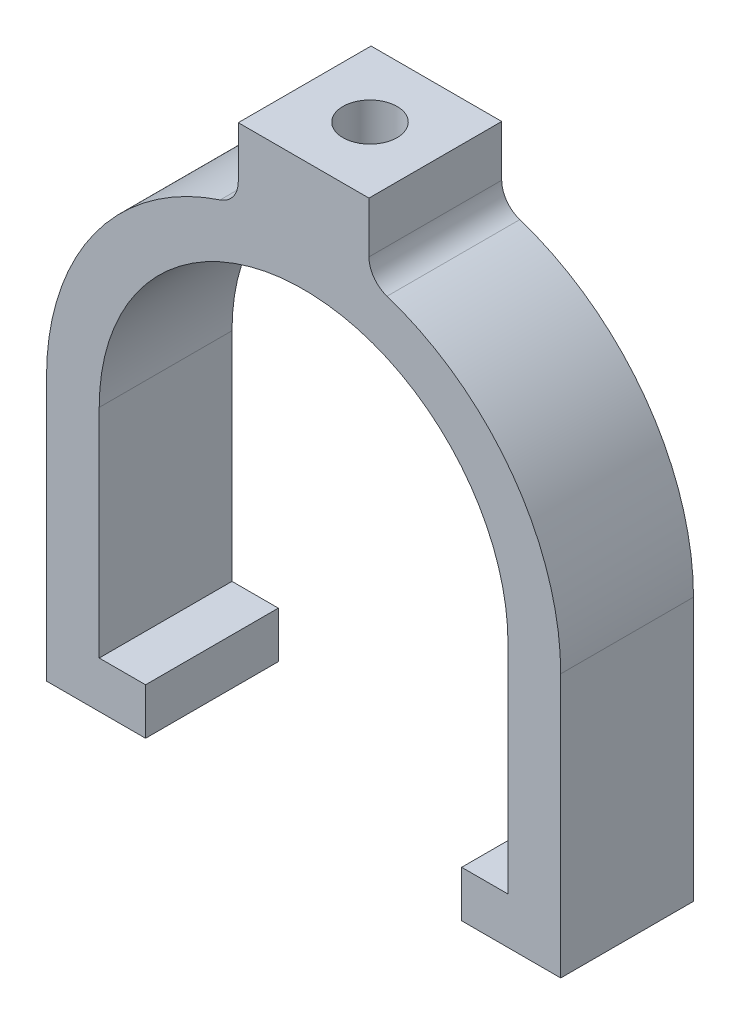
ISO-10303-21;
HEADER;
FILE_DESCRIPTION(('STEP AP214'),'2;1');
FILE_NAME('part.step','',(''),(''),'','','');
FILE_SCHEMA(('AUTOMOTIVE_DESIGN { 1 0 10303 214 1 1 1 1 }'));
ENDSEC;
DATA;
#1=APPLICATION_CONTEXT('core data for automotive mechanical design processes');
#2=APPLICATION_PROTOCOL_DEFINITION('international standard','automotive_design',2000,#1);
#3=PRODUCT_CONTEXT('',#1,'mechanical');
#4=PRODUCT('Part','Part','',(#3));
#5=PRODUCT_RELATED_PRODUCT_CATEGORY('part','',(#4));
#6=PRODUCT_DEFINITION_FORMATION('','',#4);
#7=PRODUCT_DEFINITION_CONTEXT('part definition',#1,'design');
#8=PRODUCT_DEFINITION('design','',#6,#7);
#9=PRODUCT_DEFINITION_SHAPE('','',#8);
#10=(LENGTH_UNIT() NAMED_UNIT(*) SI_UNIT(.MILLI.,.METRE.));
#11=(NAMED_UNIT(*) PLANE_ANGLE_UNIT() SI_UNIT($,.RADIAN.));
#12=(NAMED_UNIT(*) SI_UNIT($,.STERADIAN.) SOLID_ANGLE_UNIT());
#13=UNCERTAINTY_MEASURE_WITH_UNIT(LENGTH_MEASURE(1.E-05),#10,'distance_accuracy_value','');
#14=(GEOMETRIC_REPRESENTATION_CONTEXT(3) GLOBAL_UNCERTAINTY_ASSIGNED_CONTEXT((#13)) GLOBAL_UNIT_ASSIGNED_CONTEXT((#10,
#11,#12)) REPRESENTATION_CONTEXT('',''));
#15=CARTESIAN_POINT('',(0.,0.,0.));
#16=DIRECTION('',(0.,0.,1.));
#17=DIRECTION('',(1.,0.,0.));
#18=AXIS2_PLACEMENT_3D('',#15,#16,#17);
#19=CARTESIAN_POINT('',(0.,0.,16.002));
#20=DIRECTION('',(0.,0.,-1.));
#21=DIRECTION('',(-1.,0.,0.));
#22=AXIS2_PLACEMENT_3D('',#19,#20,#21);
#23=CYLINDRICAL_SURFACE('',#22,24.6349293553025);
#24=CARTESIAN_POINT('',(0.,24.6349293553025,11.2649));
#25=CARTESIAN_POINT('',(0.182477295066391,24.634926687819,11.2648923064662));
#26=CARTESIAN_POINT('',(0.365066336844417,24.6328805037974,11.2495455422252));
#27=CARTESIAN_POINT('',(0.725157182338792,24.6249147191256,11.1885701824628));
#28=CARTESIAN_POINT('',(0.902653580245628,24.6189911506863,11.1429105666369));
#29=CARTESIAN_POINT('',(1.24729446312788,24.6039374576164,11.0226838621394));
#30=CARTESIAN_POINT('',(1.41444606435645,24.5948095667605,10.9481369074574));
#31=CARTESIAN_POINT('',(1.73383668741862,24.574360581481,10.7722971923055));
#32=CARTESIAN_POINT('',(1.88607812406971,24.5630398430935,10.6710087726777));
#33=CARTESIAN_POINT('',(2.17229393058722,24.539389777283,10.4438954985144));
#34=CARTESIAN_POINT('',(2.30616326554295,24.5270552468132,10.3179388036751));
#35=CARTESIAN_POINT('',(2.55092973300952,24.5028093767103,10.0453477546269));
#36=CARTESIAN_POINT('',(2.66182565434552,24.4908980594168,9.89871231090421));
#37=CARTESIAN_POINT('',(2.85789384928716,24.4687963267119,9.58823674239901));
#38=CARTESIAN_POINT('',(2.94296676616854,24.4586126231038,9.42433335389756));
#39=CARTESIAN_POINT('',(3.08433941942857,24.4411885784362,9.08440815359293));
#40=CARTESIAN_POINT('',(3.14064037940339,24.4339481122111,8.90838685749402));
#41=CARTESIAN_POINT('',(3.22254966742672,24.4232805202168,8.55031710611364));
#42=CARTESIAN_POINT('',(3.2483361152611,24.4198312727836,8.36831006683786));
#43=CARTESIAN_POINT('',(3.26903574088053,24.4170691359014,8.00252177700253));
#44=CARTESIAN_POINT('',(3.26395030857054,24.4177560602349,7.81874060668932));
#45=CARTESIAN_POINT('',(3.22319655904242,24.4231684095786,7.45586699141634));
#46=CARTESIAN_POINT('',(3.18772505382378,24.4278678447306,7.27675199987283));
#47=CARTESIAN_POINT('',(3.08751342408681,24.4407351582205,6.92703920094534));
#48=CARTESIAN_POINT('',(3.0227726399305,24.4489031147277,6.7564415856126));
#49=CARTESIAN_POINT('',(2.86565059629395,24.4678164095599,6.42799830746867));
#50=CARTESIAN_POINT('',(2.77318442041531,24.4785696456462,6.27019374067579));
#51=CARTESIAN_POINT('',(2.56329703621076,24.5014358979219,5.97226659289486));
#52=CARTESIAN_POINT('',(2.44587454649227,24.5135489839182,5.83214492043156));
#53=CARTESIAN_POINT('',(2.18831990960694,24.5378854446139,5.57241921185461));
#54=CARTESIAN_POINT('',(2.04801823886873,24.5501089443614,5.45298322976456));
#55=CARTESIAN_POINT('',(1.74926990974521,24.5732010020668,5.23932981558359));
#56=CARTESIAN_POINT('',(1.59082320023426,24.5840695562067,5.14511245455139));
#57=CARTESIAN_POINT('',(1.26014840322894,24.6032350889691,4.98456826259667));
#58=CARTESIAN_POINT('',(1.08791481048324,24.6115310338112,4.91825263993302));
#59=CARTESIAN_POINT('',(0.734622100735637,24.6246074883933,4.81553134211751));
#60=CARTESIAN_POINT('',(0.553563448796386,24.6293881831668,4.77912409265663));
#61=CARTESIAN_POINT('',(0.189212534154061,24.6348713073908,4.7374724070735));
#62=CARTESIAN_POINT('',(0.00594715922095119,24.635604015351,4.731996600111));
#63=CARTESIAN_POINT('',(-0.358887658590362,24.6329905492089,4.75175165237506));
#64=CARTESIAN_POINT('',(-0.540457142050211,24.6296444729627,4.77698177492074));
#65=CARTESIAN_POINT('',(-0.896058287663356,24.6192682161786,4.85724022183569));
#66=CARTESIAN_POINT('',(-1.07011543633544,24.6122517619122,4.91215754906424));
#67=CARTESIAN_POINT('',(-1.40655024610518,24.5953198553614,5.0501156410819));
#68=CARTESIAN_POINT('',(-1.56892746632877,24.585404293718,5.13315746679201));
#69=CARTESIAN_POINT('',(-1.87842199094253,24.5637031270432,5.32556230781356));
#70=CARTESIAN_POINT('',(-2.02544601184283,24.55190707963,5.43507417669855));
#71=CARTESIAN_POINT('',(-2.29910995846418,24.5277953750702,5.67710082643969));
#72=CARTESIAN_POINT('',(-2.42574897045137,24.5154796946628,5.80961663786724));
#73=CARTESIAN_POINT('',(-2.65587491401639,24.491622618108,6.09491183959354));
#74=CARTESIAN_POINT('',(-2.7592079772703,24.4800867009389,6.24781586950581));
#75=CARTESIAN_POINT('',(-2.93872396594442,24.4591873942987,6.56894561342848));
#76=CARTESIAN_POINT('',(-3.0149074913018,24.4498239568229,6.73717098877216));
#77=CARTESIAN_POINT('',(-3.13771568935901,24.4343678155246,7.08368226448073));
#78=CARTESIAN_POINT('',(-3.18442548383509,24.4282657007027,7.26193755870111));
#79=CARTESIAN_POINT('',(-3.24723359105593,24.4199966939658,7.62384813177584));
#80=CARTESIAN_POINT('',(-3.26333351886918,24.4178295944279,7.8075031252066));
#81=CARTESIAN_POINT('',(-3.26443276514257,24.4176825330479,8.17346830148521));
#82=CARTESIAN_POINT('',(-3.24967385818498,24.4196700205783,8.35577779193504));
#83=CARTESIAN_POINT('',(-3.18998809210433,24.4275379998099,8.71529975717129));
#84=CARTESIAN_POINT('',(-3.14506124270471,24.4334184902564,8.89251223360051));
#85=CARTESIAN_POINT('',(-3.02639334945747,24.4483994547115,9.23676796924898));
#86=CARTESIAN_POINT('',(-2.95266544737825,24.4574984599501,9.40381582640801));
#87=CARTESIAN_POINT('',(-2.77851207243629,24.4778934527146,9.72320850573454));
#88=CARTESIAN_POINT('',(-2.67808610279616,24.48918948112,9.87555305424214));
#89=CARTESIAN_POINT('',(-2.45249527065869,24.5128116240682,10.1624486155478));
#90=CARTESIAN_POINT('',(-2.32715046536337,24.5251448307099,10.2968575641797));
#91=CARTESIAN_POINT('',(-2.05565777729653,24.5493900041002,10.5428241893124));
#92=CARTESIAN_POINT('',(-1.90950501880091,24.5613018713014,10.6543764950542));
#93=CARTESIAN_POINT('',(-1.59982358458707,24.5834190088614,10.8518751611913));
#94=CARTESIAN_POINT('',(-1.43622344863861,24.5936167827286,10.9377102657878));
#95=CARTESIAN_POINT('',(-1.09688246919574,24.6110816924553,11.0805632789125));
#96=CARTESIAN_POINT('',(-0.921154876495345,24.6183519694044,11.137612090737));
#97=CARTESIAN_POINT('',(-0.620458808698742,24.6274160617012,11.2078162104982));
#98=CARTESIAN_POINT('',(-0.497376088328188,24.6302196139795,11.2291913278247));
#99=CARTESIAN_POINT('',(-0.249546325237752,24.6339771649355,11.2577357918984));
#100=CARTESIAN_POINT('',(-0.124799296948518,24.6349311796395,11.2649052617374));
#101=CARTESIAN_POINT('',(0.,24.6349293553025,11.2649));
#102=B_SPLINE_CURVE_WITH_KNOTS('',3,(#24,#25,#26,#27,#28,#29,#30,#31,#32,#33,#34,#35,#36,#37,
#38,#39,#40,#41,#42,#43,#44,#45,#46,#47,#48,#49,#50,#51,#52,#53,#54,#55,#56,#57,#58,#59,#60,#61,
#62,#63,#64,#65,#66,#67,#68,#69,#70,#71,#72,#73,#74,#75,#76,#77,#78,#79,#80,#81,#82,#83,#84,#85,
#86,#87,#88,#89,#90,#91,#92,#93,#94,#95,#96,#97,#98,#99,#100,#101),.UNSPECIFIED.,.T.,.F.,(4,2,2,
2,2,2,2,2,2,2,2,2,2,2,2,2,2,2,2,2,2,2,2,2,2,2,2,2,2,2,2,2,2,2,2,2,2,2,4),(0.,0.546975984262547,
1.09451257463112,1.6416682256243,2.1887351134372,2.7388097920835,3.28891346368488,
3.84110764365885,4.39327833830217,4.94220974002988,5.49111642810812,6.03649447374614,
6.58188481111169,7.12896291695417,7.67606911954435,8.22743049404354,8.778793422102,
9.33037762425227,9.88193279039875,10.4293567395596,10.9767675554653,11.5221456782752,
12.0675443762986,12.6160845417929,13.1646492881069,13.7167360938083,14.2688106990099,
14.8192834951688,15.3697272459238,15.915874513738,16.4620216055236,17.007919783814,
17.5538281204744,18.1038319460166,18.6539648613366,19.2064444514987,19.7583296629368,
20.1324189969456,20.5065050894584),.UNSPECIFIED.);
#103=CARTESIAN_POINT('',(0.,24.6349293553025,11.2649));
#104=VERTEX_POINT('',#103);
#105=EDGE_CURVE('E396',#104,#104,#102,.T.);
#106=ORIENTED_EDGE('',*,*,#105,.T.);
#107=EDGE_LOOP('',(#106));
#108=FACE_BOUND('',#107,.T.);
#109=CARTESIAN_POINT('',(0.,0.,0.));
#110=DIRECTION('',(0.,0.,-1.));
#111=DIRECTION('',(-1.,0.,0.));
#112=AXIS2_PLACEMENT_3D('',#109,#110,#111);
#113=CIRCLE('',#112,24.6349293553025);
#114=CARTESIAN_POINT('',(-24.6349293553025,0.,0.));
#115=VERTEX_POINT('',#114);
#116=CARTESIAN_POINT('',(24.6349293553025,0.,0.));
#117=VERTEX_POINT('',#116);
#118=EDGE_CURVE('E197',#115,#117,#113,.T.);
#119=ORIENTED_EDGE('',*,*,#118,.T.);
#120=DIRECTION('',(0.,0.,-1.));
#121=VECTOR('',#120,1.);
#122=CARTESIAN_POINT('',(24.6349293553025,0.,16.002));
#123=LINE('',#122,#121);
#124=CARTESIAN_POINT('',(24.6349293553025,0.,16.002));
#125=VERTEX_POINT('',#124);
#126=EDGE_CURVE('E176',#125,#117,#123,.T.);
#127=ORIENTED_EDGE('',*,*,#126,.F.);
#128=CARTESIAN_POINT('',(0.,0.,16.002));
#129=DIRECTION('',(0.,0.,-1.));
#130=DIRECTION('',(-1.,0.,0.));
#131=AXIS2_PLACEMENT_3D('',#128,#129,#130);
#132=CIRCLE('',#131,24.6349293553025);
#133=CARTESIAN_POINT('',(-24.6349293553025,0.,16.002));
#134=VERTEX_POINT('',#133);
#135=EDGE_CURVE('E184',#134,#125,#132,.T.);
#136=ORIENTED_EDGE('',*,*,#135,.F.);
#137=DIRECTION('',(0.,0.,-1.));
#138=VECTOR('',#137,1.);
#139=CARTESIAN_POINT('',(-24.6349293553025,0.,16.002));
#140=LINE('',#139,#138);
#141=EDGE_CURVE('E290',#134,#115,#140,.T.);
#142=ORIENTED_EDGE('',*,*,#141,.T.);
#143=EDGE_LOOP('',(#119,#127,#136,#142));
#144=FACE_BOUND('',#143,.T.);
#145=ADVANCED_FACE('F46',(#108,#144),#23,.F.);
#146=CARTESIAN_POINT('',(24.6349293553025,-26.162,16.002));
#147=DIRECTION('',(1.,0.,0.));
#148=DIRECTION('',(0.,1.,0.));
#149=AXIS2_PLACEMENT_3D('',#146,#147,#148);
#150=PLANE('',#149);
#151=DIRECTION('',(0.,-1.,0.));
#152=VECTOR('',#151,1.);
#153=CARTESIAN_POINT('',(24.6349293553025,-26.162,0.));
#154=LINE('',#153,#152);
#155=CARTESIAN_POINT('',(24.6349293553025,-26.162,0.));
#156=VERTEX_POINT('',#155);
#157=EDGE_CURVE('E352',#117,#156,#154,.T.);
#158=ORIENTED_EDGE('',*,*,#157,.T.);
#159=DIRECTION('',(0.,0.,-1.));
#160=VECTOR('',#159,1.);
#161=CARTESIAN_POINT('',(24.6349293553025,-26.162,16.002));
#162=LINE('',#161,#160);
#163=CARTESIAN_POINT('',(24.6349293553025,-26.162,16.002));
#164=VERTEX_POINT('',#163);
#165=EDGE_CURVE('E179',#164,#156,#162,.T.);
#166=ORIENTED_EDGE('',*,*,#165,.F.);
#167=DIRECTION('',(0.,-1.,0.));
#168=VECTOR('',#167,1.);
#169=CARTESIAN_POINT('',(24.6349293553025,-26.162,16.002));
#170=LINE('',#169,#168);
#171=EDGE_CURVE('E172',#125,#164,#170,.T.);
#172=ORIENTED_EDGE('',*,*,#171,.F.);
#173=ORIENTED_EDGE('',*,*,#126,.T.);
#174=EDGE_LOOP('',(#158,#166,#172,#173));
#175=FACE_BOUND('',#174,.T.);
#176=ADVANCED_FACE('F174',(#175),#150,.F.);
#177=CARTESIAN_POINT('',(24.6349293553025,-26.162,16.002));
#178=DIRECTION('',(0.,-1.,0.));
#179=DIRECTION('',(1.,0.,0.));
#180=AXIS2_PLACEMENT_3D('',#177,#178,#179);
#181=PLANE('',#180);
#182=DIRECTION('',(-1.,0.,0.));
#183=VECTOR('',#182,1.);
#184=CARTESIAN_POINT('',(24.6349293553025,-26.162,0.));
#185=LINE('',#184,#183);
#186=CARTESIAN_POINT('',(19.05,-26.162,0.));
#187=VERTEX_POINT('',#186);
#188=EDGE_CURVE('E342',#156,#187,#185,.T.);
#189=ORIENTED_EDGE('',*,*,#188,.T.);
#190=DIRECTION('',(0.,0.,-1.));
#191=VECTOR('',#190,1.);
#192=CARTESIAN_POINT('',(19.05,-26.162,16.002));
#193=LINE('',#192,#191);
#194=CARTESIAN_POINT('',(19.05,-26.162,16.002));
#195=VERTEX_POINT('',#194);
#196=EDGE_CURVE('E207',#195,#187,#193,.T.);
#197=ORIENTED_EDGE('',*,*,#196,.F.);
#198=DIRECTION('',(-1.,0.,0.));
#199=VECTOR('',#198,1.);
#200=CARTESIAN_POINT('',(24.6349293553025,-26.162,16.002));
#201=LINE('',#200,#199);
#202=EDGE_CURVE('E183',#164,#195,#201,.T.);
#203=ORIENTED_EDGE('',*,*,#202,.F.);
#204=ORIENTED_EDGE('',*,*,#165,.T.);
#205=EDGE_LOOP('',(#189,#197,#203,#204));
#206=FACE_BOUND('',#205,.T.);
#207=ADVANCED_FACE('F399',(#206),#181,.F.);
#208=CARTESIAN_POINT('',(19.05,-26.162,16.002));
#209=DIRECTION('',(1.,0.,0.));
#210=DIRECTION('',(0.,0.,-1.));
#211=AXIS2_PLACEMENT_3D('',#208,#209,#210);
#212=PLANE('',#211);
#213=DIRECTION('',(0.,-1.,0.));
#214=VECTOR('',#213,1.);
#215=CARTESIAN_POINT('',(19.05,-26.162,0.));
#216=LINE('',#215,#214);
#217=CARTESIAN_POINT('',(19.05,-31.75,0.));
#218=VERTEX_POINT('',#217);
#219=EDGE_CURVE('E337',#187,#218,#216,.T.);
#220=ORIENTED_EDGE('',*,*,#219,.T.);
#221=DIRECTION('',(0.,0.,-1.));
#222=VECTOR('',#221,1.);
#223=CARTESIAN_POINT('',(19.05,-31.75,16.002));
#224=LINE('',#223,#222);
#225=CARTESIAN_POINT('',(19.05,-31.75,16.002));
#226=VERTEX_POINT('',#225);
#227=EDGE_CURVE('E325',#226,#218,#224,.T.);
#228=ORIENTED_EDGE('',*,*,#227,.F.);
#229=DIRECTION('',(0.,-1.,0.));
#230=VECTOR('',#229,1.);
#231=CARTESIAN_POINT('',(19.05,-26.162,16.002));
#232=LINE('',#231,#230);
#233=EDGE_CURVE('E338',#195,#226,#232,.T.);
#234=ORIENTED_EDGE('',*,*,#233,.F.);
#235=ORIENTED_EDGE('',*,*,#196,.T.);
#236=EDGE_LOOP('',(#220,#228,#234,#235));
#237=FACE_BOUND('',#236,.T.);
#238=ADVANCED_FACE('F335',(#237),#212,.F.);
#239=CARTESIAN_POINT('',(19.05,-31.75,16.002));
#240=DIRECTION('',(0.,1.,0.));
#241=DIRECTION('',(0.,0.,1.));
#242=AXIS2_PLACEMENT_3D('',#239,#240,#241);
#243=PLANE('',#242);
#244=DIRECTION('',(1.,0.,0.));
#245=VECTOR('',#244,1.);
#246=CARTESIAN_POINT('',(19.05,-31.75,0.));
#247=LINE('',#246,#245);
#248=CARTESIAN_POINT('',(30.988,-31.75,0.));
#249=VERTEX_POINT('',#248);
#250=EDGE_CURVE('E344',#218,#249,#247,.T.);
#251=ORIENTED_EDGE('',*,*,#250,.T.);
#252=DIRECTION('',(0.,0.,-1.));
#253=VECTOR('',#252,1.);
#254=CARTESIAN_POINT('',(30.988,-31.75,16.002));
#255=LINE('',#254,#253);
#256=CARTESIAN_POINT('',(30.988,-31.75,16.002));
#257=VERTEX_POINT('',#256);
#258=EDGE_CURVE('E321',#257,#249,#255,.T.);
#259=ORIENTED_EDGE('',*,*,#258,.F.);
#260=DIRECTION('',(1.,0.,0.));
#261=VECTOR('',#260,1.);
#262=CARTESIAN_POINT('',(19.05,-31.75,16.002));
#263=LINE('',#262,#261);
#264=EDGE_CURVE('E404',#226,#257,#263,.T.);
#265=ORIENTED_EDGE('',*,*,#264,.F.);
#266=ORIENTED_EDGE('',*,*,#227,.T.);
#267=EDGE_LOOP('',(#251,#259,#265,#266));
#268=FACE_BOUND('',#267,.T.);
#269=ADVANCED_FACE('F438',(#268),#243,.F.);
#270=CARTESIAN_POINT('',(30.988,-31.75,16.002));
#271=DIRECTION('',(-1.,0.,0.));
#272=DIRECTION('',(0.,-1.,0.));
#273=AXIS2_PLACEMENT_3D('',#270,#271,#272);
#274=PLANE('',#273);
#275=DIRECTION('',(0.,1.,0.));
#276=VECTOR('',#275,1.);
#277=CARTESIAN_POINT('',(30.988,-31.75,0.));
#278=LINE('',#277,#276);
#279=CARTESIAN_POINT('',(30.988,0.,0.));
#280=VERTEX_POINT('',#279);
#281=EDGE_CURVE('E350',#249,#280,#278,.T.);
#282=ORIENTED_EDGE('',*,*,#281,.T.);
#283=DIRECTION('',(0.,0.,-1.));
#284=VECTOR('',#283,1.);
#285=CARTESIAN_POINT('',(30.988,0.,16.002));
#286=LINE('',#285,#284);
#287=CARTESIAN_POINT('',(30.988,0.,16.002));
#288=VERTEX_POINT('',#287);
#289=EDGE_CURVE('E317',#288,#280,#286,.T.);
#290=ORIENTED_EDGE('',*,*,#289,.F.);
#291=DIRECTION('',(0.,1.,0.));
#292=VECTOR('',#291,1.);
#293=CARTESIAN_POINT('',(30.988,-31.75,16.002));
#294=LINE('',#293,#292);
#295=EDGE_CURVE('E409',#257,#288,#294,.T.);
#296=ORIENTED_EDGE('',*,*,#295,.F.);
#297=ORIENTED_EDGE('',*,*,#258,.T.);
#298=EDGE_LOOP('',(#282,#290,#296,#297));
#299=FACE_BOUND('',#298,.T.);
#300=ADVANCED_FACE('F441',(#299),#274,.F.);
#301=CARTESIAN_POINT('',(0.508000000000002,0.,16.002));
#302=DIRECTION('',(0.,0.,-1.));
#303=DIRECTION('',(-1.,0.,0.));
#304=AXIS2_PLACEMENT_3D('',#301,#302,#303);
#305=CYLINDRICAL_SURFACE('',#304,30.48);
#306=CARTESIAN_POINT('',(0.508000000000002,0.,0.));
#307=DIRECTION('',(0.,0.,1.));
#308=DIRECTION('',(1.,0.,0.));
#309=AXIS2_PLACEMENT_3D('',#306,#307,#308);
#310=CIRCLE('',#309,30.48);
#311=CARTESIAN_POINT('',(10.0545660377358,28.9463897038499,0.));
#312=VERTEX_POINT('',#311);
#313=EDGE_CURVE('E358',#280,#312,#310,.T.);
#314=ORIENTED_EDGE('',*,*,#313,.T.);
#315=DIRECTION('',(0.,0.,-1.));
#316=VECTOR('',#315,1.);
#317=CARTESIAN_POINT('',(10.0545660377358,28.9463897038499,16.002));
#318=LINE('',#317,#316);
#319=CARTESIAN_POINT('',(10.0545660377358,28.9463897038499,16.002));
#320=VERTEX_POINT('',#319);
#321=EDGE_CURVE('E62',#312,#320,#318,.F.);
#322=ORIENTED_EDGE('',*,*,#321,.T.);
#323=CARTESIAN_POINT('',(0.508000000000002,0.,16.002));
#324=DIRECTION('',(0.,0.,1.));
#325=DIRECTION('',(1.,0.,0.));
#326=AXIS2_PLACEMENT_3D('',#323,#324,#325);
#327=CIRCLE('',#326,30.48);
#328=EDGE_CURVE('E378',#288,#320,#327,.T.);
#329=ORIENTED_EDGE('',*,*,#328,.F.);
#330=ORIENTED_EDGE('',*,*,#289,.T.);
#331=EDGE_LOOP('',(#314,#322,#329,#330));
#332=FACE_BOUND('',#331,.T.);
#333=ADVANCED_FACE('F445',(#332),#305,.T.);
#334=CARTESIAN_POINT('',(7.874,38.1,16.002));
#335=DIRECTION('',(-1.,0.,0.));
#336=DIRECTION('',(0.,-1.,0.));
#337=AXIS2_PLACEMENT_3D('',#334,#335,#336);
#338=PLANE('',#337);
#339=DIRECTION('',(0.,1.,0.));
#340=VECTOR('',#339,1.);
#341=CARTESIAN_POINT('',(7.874,38.1,16.002));
#342=LINE('',#341,#340);
#343=CARTESIAN_POINT('',(7.874,31.9616386313343,16.002));
#344=VERTEX_POINT('',#343);
#345=CARTESIAN_POINT('',(7.874,38.1,16.002));
#346=VERTEX_POINT('',#345);
#347=EDGE_CURVE('E372',#344,#346,#342,.T.);
#348=ORIENTED_EDGE('',*,*,#347,.F.);
#349=DIRECTION('',(0.,0.,1.));
#350=VECTOR('',#349,1.);
#351=CARTESIAN_POINT('',(7.874,31.9616386313343,0.));
#352=LINE('',#351,#350);
#353=CARTESIAN_POINT('',(7.874,31.9616386313343,0.));
#354=VERTEX_POINT('',#353);
#355=EDGE_CURVE('E213',#344,#354,#352,.F.);
#356=ORIENTED_EDGE('',*,*,#355,.T.);
#357=DIRECTION('',(0.,1.,0.));
#358=VECTOR('',#357,1.);
#359=CARTESIAN_POINT('',(7.874,38.1,0.));
#360=LINE('',#359,#358);
#361=CARTESIAN_POINT('',(7.874,38.1,0.));
#362=VERTEX_POINT('',#361);
#363=EDGE_CURVE('E273',#354,#362,#360,.T.);
#364=ORIENTED_EDGE('',*,*,#363,.T.);
#365=DIRECTION('',(0.,0.,-1.));
#366=VECTOR('',#365,1.);
#367=CARTESIAN_POINT('',(7.874,38.1,16.002));
#368=LINE('',#367,#366);
#369=EDGE_CURVE('E313',#346,#362,#368,.T.);
#370=ORIENTED_EDGE('',*,*,#369,.F.);
#371=EDGE_LOOP('',(#348,#356,#364,#370));
#372=FACE_BOUND('',#371,.T.);
#373=ADVANCED_FACE('F365',(#372),#338,.F.);
#374=CARTESIAN_POINT('',(-7.874,38.1,16.002));
#375=DIRECTION('',(0.,-1.,0.));
#376=DIRECTION('',(0.,0.,-1.));
#377=AXIS2_PLACEMENT_3D('',#374,#375,#376);
#378=PLANE('',#377);
#379=CARTESIAN_POINT('',(0.,38.1,8.00100000000001));
#380=DIRECTION('',(0.,1.,0.));
#381=DIRECTION('',(0.,0.,1.));
#382=AXIS2_PLACEMENT_3D('',#379,#380,#381);
#383=CIRCLE('',#382,3.2639);
#384=CARTESIAN_POINT('',(0.,38.1,11.2649));
#385=VERTEX_POINT('',#384);
#386=EDGE_CURVE('E490',#385,#385,#383,.T.);
#387=ORIENTED_EDGE('',*,*,#386,.F.);
#388=EDGE_LOOP('',(#387));
#389=FACE_BOUND('',#388,.T.);
#390=DIRECTION('',(-1.,0.,0.));
#391=VECTOR('',#390,1.);
#392=CARTESIAN_POINT('',(-7.874,38.1,0.));
#393=LINE('',#392,#391);
#394=CARTESIAN_POINT('',(-7.874,38.1,0.));
#395=VERTEX_POINT('',#394);
#396=EDGE_CURVE('E266',#362,#395,#393,.T.);
#397=ORIENTED_EDGE('',*,*,#396,.T.);
#398=DIRECTION('',(0.,0.,-1.));
#399=VECTOR('',#398,1.);
#400=CARTESIAN_POINT('',(-7.874,38.1,16.002));
#401=LINE('',#400,#399);
#402=CARTESIAN_POINT('',(-7.874,38.1,16.002));
#403=VERTEX_POINT('',#402);
#404=EDGE_CURVE('E264',#403,#395,#401,.T.);
#405=ORIENTED_EDGE('',*,*,#404,.F.);
#406=DIRECTION('',(-1.,0.,0.));
#407=VECTOR('',#406,1.);
#408=CARTESIAN_POINT('',(-7.874,38.1,16.002));
#409=LINE('',#408,#407);
#410=EDGE_CURVE('E370',#346,#403,#409,.T.);
#411=ORIENTED_EDGE('',*,*,#410,.F.);
#412=ORIENTED_EDGE('',*,*,#369,.T.);
#413=EDGE_LOOP('',(#397,#405,#411,#412));
#414=FACE_BOUND('',#413,.T.);
#415=ADVANCED_FACE('F369',(#389,#414),#378,.F.);
#416=CARTESIAN_POINT('',(-7.874,38.1,16.002));
#417=DIRECTION('',(1.,0.,0.));
#418=DIRECTION('',(0.,1.,0.));
#419=AXIS2_PLACEMENT_3D('',#416,#417,#418);
#420=PLANE('',#419);
#421=DIRECTION('',(0.,-1.,0.));
#422=VECTOR('',#421,1.);
#423=CARTESIAN_POINT('',(-7.874,38.1,0.));
#424=LINE('',#423,#422);
#425=CARTESIAN_POINT('',(-7.874,31.9616386313343,0.));
#426=VERTEX_POINT('',#425);
#427=EDGE_CURVE('E257',#395,#426,#424,.T.);
#428=ORIENTED_EDGE('',*,*,#427,.T.);
#429=DIRECTION('',(0.,0.,1.));
#430=VECTOR('',#429,1.);
#431=CARTESIAN_POINT('',(-7.87400000000001,31.9616386313343,16.002));
#432=LINE('',#431,#430);
#433=CARTESIAN_POINT('',(-7.874,31.9616386313343,16.002));
#434=VERTEX_POINT('',#433);
#435=EDGE_CURVE('E205',#426,#434,#432,.T.);
#436=ORIENTED_EDGE('',*,*,#435,.T.);
#437=DIRECTION('',(0.,-1.,0.));
#438=VECTOR('',#437,1.);
#439=CARTESIAN_POINT('',(-7.874,38.1,16.002));
#440=LINE('',#439,#438);
#441=EDGE_CURVE('E239',#403,#434,#440,.T.);
#442=ORIENTED_EDGE('',*,*,#441,.F.);
#443=ORIENTED_EDGE('',*,*,#404,.T.);
#444=EDGE_LOOP('',(#428,#436,#442,#443));
#445=FACE_BOUND('',#444,.T.);
#446=ADVANCED_FACE('F262',(#445),#420,.F.);
#447=CARTESIAN_POINT('',(-0.507999999999998,0.,16.002));
#448=DIRECTION('',(0.,0.,-1.));
#449=DIRECTION('',(-1.,0.,0.));
#450=AXIS2_PLACEMENT_3D('',#447,#448,#449);
#451=CYLINDRICAL_SURFACE('',#450,30.48);
#452=CARTESIAN_POINT('',(-0.507999999999998,0.,16.002));
#453=DIRECTION('',(0.,0.,1.));
#454=DIRECTION('',(1.,0.,0.));
#455=AXIS2_PLACEMENT_3D('',#452,#453,#454);
#456=CIRCLE('',#455,30.48);
#457=CARTESIAN_POINT('',(-10.0545660377359,28.9463897038499,16.002));
#458=VERTEX_POINT('',#457);
#459=CARTESIAN_POINT('',(-30.988,0.,16.002));
#460=VERTEX_POINT('',#459);
#461=EDGE_CURVE('E236',#458,#460,#456,.T.);
#462=ORIENTED_EDGE('',*,*,#461,.F.);
#463=DIRECTION('',(0.,0.,-1.));
#464=VECTOR('',#463,1.);
#465=CARTESIAN_POINT('',(-10.0545660377359,28.9463897038499,16.002));
#466=LINE('',#465,#464);
#467=CARTESIAN_POINT('',(-10.0545660377359,28.9463897038499,0.));
#468=VERTEX_POINT('',#467);
#469=EDGE_CURVE('E199',#458,#468,#466,.T.);
#470=ORIENTED_EDGE('',*,*,#469,.T.);
#471=CARTESIAN_POINT('',(-0.507999999999998,0.,0.));
#472=DIRECTION('',(0.,0.,1.));
#473=DIRECTION('',(1.,0.,0.));
#474=AXIS2_PLACEMENT_3D('',#471,#472,#473);
#475=CIRCLE('',#474,30.48);
#476=CARTESIAN_POINT('',(-30.988,0.,0.));
#477=VERTEX_POINT('',#476);
#478=EDGE_CURVE('E259',#468,#477,#475,.T.);
#479=ORIENTED_EDGE('',*,*,#478,.T.);
#480=DIRECTION('',(0.,0.,-1.));
#481=VECTOR('',#480,1.);
#482=CARTESIAN_POINT('',(-30.988,0.,16.002));
#483=LINE('',#482,#481);
#484=EDGE_CURVE('E247',#460,#477,#483,.T.);
#485=ORIENTED_EDGE('',*,*,#484,.F.);
#486=EDGE_LOOP('',(#462,#470,#479,#485));
#487=FACE_BOUND('',#486,.T.);
#488=ADVANCED_FACE('F244',(#487),#451,.T.);
#489=CARTESIAN_POINT('',(-30.988,-31.75,16.002));
#490=DIRECTION('',(1.,0.,0.));
#491=DIRECTION('',(0.,1.,0.));
#492=AXIS2_PLACEMENT_3D('',#489,#490,#491);
#493=PLANE('',#492);
#494=DIRECTION('',(0.,-1.,0.));
#495=VECTOR('',#494,1.);
#496=CARTESIAN_POINT('',(-30.988,-31.75,0.));
#497=LINE('',#496,#495);
#498=CARTESIAN_POINT('',(-30.988,-31.75,0.));
#499=VERTEX_POINT('',#498);
#500=EDGE_CURVE('E271',#477,#499,#497,.T.);
#501=ORIENTED_EDGE('',*,*,#500,.T.);
#502=DIRECTION('',(0.,0.,-1.));
#503=VECTOR('',#502,1.);
#504=CARTESIAN_POINT('',(-30.988,-31.75,16.002));
#505=LINE('',#504,#503);
#506=CARTESIAN_POINT('',(-30.988,-31.75,16.002));
#507=VERTEX_POINT('',#506);
#508=EDGE_CURVE('E305',#507,#499,#505,.T.);
#509=ORIENTED_EDGE('',*,*,#508,.F.);
#510=DIRECTION('',(0.,-1.,0.));
#511=VECTOR('',#510,1.);
#512=CARTESIAN_POINT('',(-30.988,-31.75,16.002));
#513=LINE('',#512,#511);
#514=EDGE_CURVE('E250',#460,#507,#513,.T.);
#515=ORIENTED_EDGE('',*,*,#514,.F.);
#516=ORIENTED_EDGE('',*,*,#484,.T.);
#517=EDGE_LOOP('',(#501,#509,#515,#516));
#518=FACE_BOUND('',#517,.T.);
#519=ADVANCED_FACE('F458',(#518),#493,.F.);
#520=CARTESIAN_POINT('',(-19.05,-31.75,16.002));
#521=DIRECTION('',(0.,1.,0.));
#522=DIRECTION('',(0.,0.,1.));
#523=AXIS2_PLACEMENT_3D('',#520,#521,#522);
#524=PLANE('',#523);
#525=DIRECTION('',(1.,0.,0.));
#526=VECTOR('',#525,1.);
#527=CARTESIAN_POINT('',(-19.05,-31.75,0.));
#528=LINE('',#527,#526);
#529=CARTESIAN_POINT('',(-19.05,-31.75,0.));
#530=VERTEX_POINT('',#529);
#531=EDGE_CURVE('E279',#499,#530,#528,.T.);
#532=ORIENTED_EDGE('',*,*,#531,.T.);
#533=DIRECTION('',(0.,0.,-1.));
#534=VECTOR('',#533,1.);
#535=CARTESIAN_POINT('',(-19.05,-31.75,16.002));
#536=LINE('',#535,#534);
#537=CARTESIAN_POINT('',(-19.05,-31.75,16.002));
#538=VERTEX_POINT('',#537);
#539=EDGE_CURVE('E301',#538,#530,#536,.T.);
#540=ORIENTED_EDGE('',*,*,#539,.F.);
#541=DIRECTION('',(1.,0.,0.));
#542=VECTOR('',#541,1.);
#543=CARTESIAN_POINT('',(-19.05,-31.75,16.002));
#544=LINE('',#543,#542);
#545=EDGE_CURVE('E384',#507,#538,#544,.T.);
#546=ORIENTED_EDGE('',*,*,#545,.F.);
#547=ORIENTED_EDGE('',*,*,#508,.T.);
#548=EDGE_LOOP('',(#532,#540,#546,#547));
#549=FACE_BOUND('',#548,.T.);
#550=ADVANCED_FACE('F461',(#549),#524,.F.);
#551=CARTESIAN_POINT('',(-19.05,-26.162,16.002));
#552=DIRECTION('',(-1.,0.,0.));
#553=DIRECTION('',(0.,-1.,0.));
#554=AXIS2_PLACEMENT_3D('',#551,#552,#553);
#555=PLANE('',#554);
#556=DIRECTION('',(0.,1.,0.));
#557=VECTOR('',#556,1.);
#558=CARTESIAN_POINT('',(-19.05,-26.162,0.));
#559=LINE('',#558,#557);
#560=CARTESIAN_POINT('',(-19.05,-26.162,0.));
#561=VERTEX_POINT('',#560);
#562=EDGE_CURVE('E282',#530,#561,#559,.T.);
#563=ORIENTED_EDGE('',*,*,#562,.T.);
#564=DIRECTION('',(0.,0.,-1.));
#565=VECTOR('',#564,1.);
#566=CARTESIAN_POINT('',(-19.05,-26.162,16.002));
#567=LINE('',#566,#565);
#568=CARTESIAN_POINT('',(-19.05,-26.162,16.002));
#569=VERTEX_POINT('',#568);
#570=EDGE_CURVE('E297',#569,#561,#567,.T.);
#571=ORIENTED_EDGE('',*,*,#570,.F.);
#572=DIRECTION('',(0.,1.,0.));
#573=VECTOR('',#572,1.);
#574=CARTESIAN_POINT('',(-19.05,-26.162,16.002));
#575=LINE('',#574,#573);
#576=EDGE_CURVE('E387',#538,#569,#575,.T.);
#577=ORIENTED_EDGE('',*,*,#576,.F.);
#578=ORIENTED_EDGE('',*,*,#539,.T.);
#579=EDGE_LOOP('',(#563,#571,#577,#578));
#580=FACE_BOUND('',#579,.T.);
#581=ADVANCED_FACE('F465',(#580),#555,.F.);
#582=CARTESIAN_POINT('',(-24.6349293553025,-26.162,16.002));
#583=DIRECTION('',(0.,-1.,0.));
#584=DIRECTION('',(0.,0.,-1.));
#585=AXIS2_PLACEMENT_3D('',#582,#583,#584);
#586=PLANE('',#585);
#587=DIRECTION('',(-1.,0.,0.));
#588=VECTOR('',#587,1.);
#589=CARTESIAN_POINT('',(-24.6349293553025,-26.162,0.));
#590=LINE('',#589,#588);
#591=CARTESIAN_POINT('',(-24.6349293553025,-26.162,0.));
#592=VERTEX_POINT('',#591);
#593=EDGE_CURVE('E285',#561,#592,#590,.T.);
#594=ORIENTED_EDGE('',*,*,#593,.T.);
#595=DIRECTION('',(0.,0.,-1.));
#596=VECTOR('',#595,1.);
#597=CARTESIAN_POINT('',(-24.6349293553025,-26.162,16.002));
#598=LINE('',#597,#596);
#599=CARTESIAN_POINT('',(-24.6349293553025,-26.162,16.002));
#600=VERTEX_POINT('',#599);
#601=EDGE_CURVE('E293',#600,#592,#598,.T.);
#602=ORIENTED_EDGE('',*,*,#601,.F.);
#603=DIRECTION('',(-1.,0.,0.));
#604=VECTOR('',#603,1.);
#605=CARTESIAN_POINT('',(-24.6349293553025,-26.162,16.002));
#606=LINE('',#605,#604);
#607=EDGE_CURVE('E390',#569,#600,#606,.T.);
#608=ORIENTED_EDGE('',*,*,#607,.F.);
#609=ORIENTED_EDGE('',*,*,#570,.T.);
#610=EDGE_LOOP('',(#594,#602,#608,#609));
#611=FACE_BOUND('',#610,.T.);
#612=ADVANCED_FACE('F469',(#611),#586,.F.);
#613=CARTESIAN_POINT('',(-24.6349293553025,0.,16.002));
#614=DIRECTION('',(-1.,0.,0.));
#615=DIRECTION('',(0.,-1.,0.));
#616=AXIS2_PLACEMENT_3D('',#613,#614,#615);
#617=PLANE('',#616);
#618=DIRECTION('',(0.,1.,0.));
#619=VECTOR('',#618,1.);
#620=CARTESIAN_POINT('',(-24.6349293553025,0.,0.));
#621=LINE('',#620,#619);
#622=EDGE_CURVE('E194',#592,#115,#621,.T.);
#623=ORIENTED_EDGE('',*,*,#622,.T.);
#624=ORIENTED_EDGE('',*,*,#141,.F.);
#625=DIRECTION('',(0.,1.,0.));
#626=VECTOR('',#625,1.);
#627=CARTESIAN_POINT('',(-24.6349293553025,0.,16.002));
#628=LINE('',#627,#626);
#629=EDGE_CURVE('E189',#600,#134,#628,.T.);
#630=ORIENTED_EDGE('',*,*,#629,.F.);
#631=ORIENTED_EDGE('',*,*,#601,.T.);
#632=EDGE_LOOP('',(#623,#624,#630,#631));
#633=FACE_BOUND('',#632,.T.);
#634=ADVANCED_FACE('F473',(#633),#617,.F.);
#635=CARTESIAN_POINT('',(0.,0.,16.002));
#636=DIRECTION('',(0.,0.,-1.));
#637=DIRECTION('',(-1.,0.,0.));
#638=AXIS2_PLACEMENT_3D('',#635,#636,#637);
#639=PLANE('',#638);
#640=ORIENTED_EDGE('',*,*,#135,.T.);
#641=ORIENTED_EDGE('',*,*,#171,.T.);
#642=ORIENTED_EDGE('',*,*,#202,.T.);
#643=ORIENTED_EDGE('',*,*,#233,.T.);
#644=ORIENTED_EDGE('',*,*,#264,.T.);
#645=ORIENTED_EDGE('',*,*,#295,.T.);
#646=ORIENTED_EDGE('',*,*,#328,.T.);
#647=CARTESIAN_POINT('',(11.049,31.9616386313343,16.002));
#648=DIRECTION('',(0.,0.,-1.));
#649=DIRECTION('',(-1.,0.,0.));
#650=AXIS2_PLACEMENT_3D('',#647,#648,#649);
#651=CIRCLE('',#650,3.175);
#652=EDGE_CURVE('E11',#320,#344,#651,.T.);
#653=ORIENTED_EDGE('',*,*,#652,.T.);
#654=ORIENTED_EDGE('',*,*,#347,.T.);
#655=ORIENTED_EDGE('',*,*,#410,.T.);
#656=ORIENTED_EDGE('',*,*,#441,.T.);
#657=CARTESIAN_POINT('',(-11.049,31.9616386313343,16.002));
#658=DIRECTION('',(0.,0.,-1.));
#659=DIRECTION('',(-1.,0.,0.));
#660=AXIS2_PLACEMENT_3D('',#657,#658,#659);
#661=CIRCLE('',#660,3.175);
#662=EDGE_CURVE('E222',#434,#458,#661,.T.);
#663=ORIENTED_EDGE('',*,*,#662,.T.);
#664=ORIENTED_EDGE('',*,*,#461,.T.);
#665=ORIENTED_EDGE('',*,*,#514,.T.);
#666=ORIENTED_EDGE('',*,*,#545,.T.);
#667=ORIENTED_EDGE('',*,*,#576,.T.);
#668=ORIENTED_EDGE('',*,*,#607,.T.);
#669=ORIENTED_EDGE('',*,*,#629,.T.);
#670=EDGE_LOOP('',(#640,#641,#642,#643,#644,#645,#646,#653,#654,#655,#656,#663,#664,#665,#666,
#667,#668,#669));
#671=FACE_BOUND('',#670,.T.);
#672=ADVANCED_FACE('F187',(#671),#639,.F.);
#673=CARTESIAN_POINT('',(0.,0.,0.));
#674=DIRECTION('',(0.,0.,-1.));
#675=DIRECTION('',(-1.,0.,0.));
#676=AXIS2_PLACEMENT_3D('',#673,#674,#675);
#677=PLANE('',#676);
#678=ORIENTED_EDGE('',*,*,#118,.F.);
#679=ORIENTED_EDGE('',*,*,#622,.F.);
#680=ORIENTED_EDGE('',*,*,#593,.F.);
#681=ORIENTED_EDGE('',*,*,#562,.F.);
#682=ORIENTED_EDGE('',*,*,#531,.F.);
#683=ORIENTED_EDGE('',*,*,#500,.F.);
#684=ORIENTED_EDGE('',*,*,#478,.F.);
#685=CARTESIAN_POINT('',(-11.049,31.9616386313343,0.));
#686=DIRECTION('',(0.,0.,-1.));
#687=DIRECTION('',(-1.,0.,0.));
#688=AXIS2_PLACEMENT_3D('',#685,#686,#687);
#689=CIRCLE('',#688,3.175);
#690=EDGE_CURVE('E219',#468,#426,#689,.F.);
#691=ORIENTED_EDGE('',*,*,#690,.T.);
#692=ORIENTED_EDGE('',*,*,#427,.F.);
#693=ORIENTED_EDGE('',*,*,#396,.F.);
#694=ORIENTED_EDGE('',*,*,#363,.F.);
#695=CARTESIAN_POINT('',(11.049,31.9616386313343,0.));
#696=DIRECTION('',(0.,0.,-1.));
#697=DIRECTION('',(-1.,0.,0.));
#698=AXIS2_PLACEMENT_3D('',#695,#696,#697);
#699=CIRCLE('',#698,3.175);
#700=EDGE_CURVE('E55',#354,#312,#699,.F.);
#701=ORIENTED_EDGE('',*,*,#700,.T.);
#702=ORIENTED_EDGE('',*,*,#313,.F.);
#703=ORIENTED_EDGE('',*,*,#281,.F.);
#704=ORIENTED_EDGE('',*,*,#250,.F.);
#705=ORIENTED_EDGE('',*,*,#219,.F.);
#706=ORIENTED_EDGE('',*,*,#188,.F.);
#707=ORIENTED_EDGE('',*,*,#157,.F.);
#708=EDGE_LOOP('',(#678,#679,#680,#681,#682,#683,#684,#691,#692,#693,#694,#701,#702,#703,#704,
#705,#706,#707));
#709=FACE_BOUND('',#708,.T.);
#710=ADVANCED_FACE('F255',(#709),#677,.T.);
#711=CARTESIAN_POINT('',(-11.049,31.9616386313343,16.002));
#712=DIRECTION('',(0.,0.,-1.));
#713=DIRECTION('',(-1.,0.,0.));
#714=AXIS2_PLACEMENT_3D('',#711,#712,#713);
#715=CYLINDRICAL_SURFACE('',#714,3.175);
#716=ORIENTED_EDGE('',*,*,#662,.F.);
#717=ORIENTED_EDGE('',*,*,#435,.F.);
#718=ORIENTED_EDGE('',*,*,#690,.F.);
#719=ORIENTED_EDGE('',*,*,#469,.F.);
#720=EDGE_LOOP('',(#716,#717,#718,#719));
#721=FACE_BOUND('',#720,.T.);
#722=ADVANCED_FACE('F252',(#721),#715,.F.);
#723=CARTESIAN_POINT('',(11.049,31.9616386313343,16.002));
#724=DIRECTION('',(0.,0.,-1.));
#725=DIRECTION('',(-1.,0.,0.));
#726=AXIS2_PLACEMENT_3D('',#723,#724,#725);
#727=CYLINDRICAL_SURFACE('',#726,3.175);
#728=ORIENTED_EDGE('',*,*,#652,.F.);
#729=ORIENTED_EDGE('',*,*,#321,.F.);
#730=ORIENTED_EDGE('',*,*,#700,.F.);
#731=ORIENTED_EDGE('',*,*,#355,.F.);
#732=EDGE_LOOP('',(#728,#729,#730,#731));
#733=FACE_BOUND('',#732,.T.);
#734=ADVANCED_FACE('F48',(#733),#727,.F.);
#735=CARTESIAN_POINT('',(0.,38.1,8.00100000000001));
#736=DIRECTION('',(0.,1.,0.));
#737=DIRECTION('',(0.,0.,1.));
#738=AXIS2_PLACEMENT_3D('',#735,#736,#737);
#739=CYLINDRICAL_SURFACE('',#738,3.2639);
#740=ORIENTED_EDGE('',*,*,#105,.F.);
#741=EDGE_LOOP('',(#740));
#742=FACE_BOUND('',#741,.T.);
#743=ORIENTED_EDGE('',*,*,#386,.T.);
#744=EDGE_LOOP('',(#743));
#745=FACE_BOUND('',#744,.T.);
#746=ADVANCED_FACE('F418',(#742,#745),#739,.F.);
#747=CLOSED_SHELL('',(#145,#176,#207,#238,#269,#300,#333,#373,#415,#446,#488,#519,#550,#581,
#612,#634,#672,#710,#722,#734,#746));
#748=MANIFOLD_SOLID_BREP('B2',#747);
#749=ADVANCED_BREP_SHAPE_REPRESENTATION('',(#18,#748),#14);
#750=SHAPE_DEFINITION_REPRESENTATION(#9,#749);
ENDSEC;
END-ISO-10303-21;
